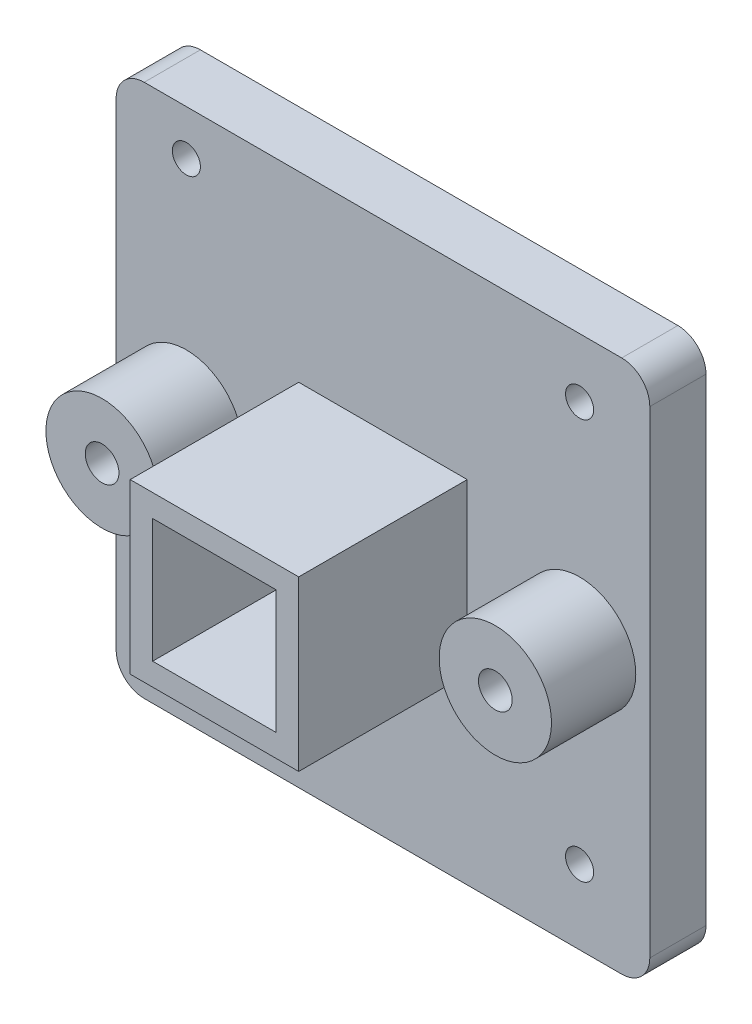
ISO-10303-21;
HEADER;
FILE_DESCRIPTION(('STEP AP214'),'2;1');
FILE_NAME('part.step','',(''),(''),'','','');
FILE_SCHEMA(('AUTOMOTIVE_DESIGN { 1 0 10303 214 1 1 1 1 }'));
ENDSEC;
DATA;
#1=APPLICATION_CONTEXT('core data for automotive mechanical design processes');
#2=APPLICATION_PROTOCOL_DEFINITION('international standard','automotive_design',2000,#1);
#3=PRODUCT_CONTEXT('',#1,'mechanical');
#4=PRODUCT('Part','Part','',(#3));
#5=PRODUCT_RELATED_PRODUCT_CATEGORY('part','',(#4));
#6=PRODUCT_DEFINITION_FORMATION('','',#4);
#7=PRODUCT_DEFINITION_CONTEXT('part definition',#1,'design');
#8=PRODUCT_DEFINITION('design','',#6,#7);
#9=PRODUCT_DEFINITION_SHAPE('','',#8);
#10=(LENGTH_UNIT() NAMED_UNIT(*) SI_UNIT(.MILLI.,.METRE.));
#11=(NAMED_UNIT(*) PLANE_ANGLE_UNIT() SI_UNIT($,.RADIAN.));
#12=(NAMED_UNIT(*) SI_UNIT($,.STERADIAN.) SOLID_ANGLE_UNIT());
#13=UNCERTAINTY_MEASURE_WITH_UNIT(LENGTH_MEASURE(1.E-05),#10,'distance_accuracy_value','');
#14=(GEOMETRIC_REPRESENTATION_CONTEXT(3) GLOBAL_UNCERTAINTY_ASSIGNED_CONTEXT((#13)) GLOBAL_UNIT_ASSIGNED_CONTEXT((#10,
#11,#12)) REPRESENTATION_CONTEXT('',''));
#15=CARTESIAN_POINT('',(0.,0.,0.));
#16=DIRECTION('',(0.,0.,1.));
#17=DIRECTION('',(1.,0.,0.));
#18=AXIS2_PLACEMENT_3D('',#15,#16,#17);
#19=CARTESIAN_POINT('',(0.,0.,20.));
#20=DIRECTION('',(0.,0.,-1.));
#21=DIRECTION('',(-1.,0.,0.));
#22=AXIS2_PLACEMENT_3D('',#19,#20,#21);
#23=PLANE('',#22);
#24=CARTESIAN_POINT('',(-70.,78.9364396639575,20.));
#25=DIRECTION('',(0.,0.,1.));
#26=DIRECTION('',(1.,0.,0.));
#27=AXIS2_PLACEMENT_3D('',#24,#25,#26);
#28=CIRCLE('',#27,5.00000000000001);
#29=CARTESIAN_POINT('',(-65.,78.9364396639575,20.));
#30=VERTEX_POINT('',#29);
#31=EDGE_CURVE('E219',#30,#30,#28,.T.);
#32=ORIENTED_EDGE('',*,*,#31,.F.);
#33=EDGE_LOOP('',(#32));
#34=FACE_BOUND('',#33,.T.);
#35=CARTESIAN_POINT('',(70.,73.9364396639575,20.));
#36=DIRECTION('',(0.,0.,1.));
#37=DIRECTION('',(1.,0.,0.));
#38=AXIS2_PLACEMENT_3D('',#35,#36,#37);
#39=CIRCLE('',#38,5.00000000000001);
#40=CARTESIAN_POINT('',(75.,73.9364396639575,20.));
#41=VERTEX_POINT('',#40);
#42=EDGE_CURVE('E225',#41,#41,#39,.T.);
#43=ORIENTED_EDGE('',*,*,#42,.F.);
#44=EDGE_LOOP('',(#43));
#45=FACE_BOUND('',#44,.T.);
#46=CARTESIAN_POINT('',(-70.,-73.5968858543431,20.));
#47=DIRECTION('',(0.,0.,1.));
#48=DIRECTION('',(1.,0.,0.));
#49=AXIS2_PLACEMENT_3D('',#46,#47,#48);
#50=CIRCLE('',#49,5.00000000000001);
#51=CARTESIAN_POINT('',(-65.,-73.5968858543431,20.));
#52=VERTEX_POINT('',#51);
#53=EDGE_CURVE('E231',#52,#52,#50,.T.);
#54=ORIENTED_EDGE('',*,*,#53,.F.);
#55=EDGE_LOOP('',(#54));
#56=FACE_BOUND('',#55,.T.);
#57=CARTESIAN_POINT('',(70.,-68.5968858543431,20.));
#58=DIRECTION('',(0.,0.,1.));
#59=DIRECTION('',(1.,0.,0.));
#60=AXIS2_PLACEMENT_3D('',#57,#58,#59);
#61=CIRCLE('',#60,5.00000000000001);
#62=CARTESIAN_POINT('',(75.,-68.5968858543431,20.));
#63=VERTEX_POINT('',#62);
#64=EDGE_CURVE('E237',#63,#63,#61,.T.);
#65=ORIENTED_EDGE('',*,*,#64,.F.);
#66=EDGE_LOOP('',(#65));
#67=FACE_BOUND('',#66,.T.);
#68=DIRECTION('',(0.,1.,0.));
#69=VECTOR('',#68,1.);
#70=CARTESIAN_POINT('',(95.,-95.,20.));
#71=LINE('',#70,#69);
#72=CARTESIAN_POINT('',(95.,-85.,20.));
#73=VERTEX_POINT('',#72);
#74=CARTESIAN_POINT('',(95.,85.,20.));
#75=VERTEX_POINT('',#74);
#76=EDGE_CURVE('E261',#73,#75,#71,.T.);
#77=ORIENTED_EDGE('',*,*,#76,.T.);
#78=CARTESIAN_POINT('',(85.,85.,20.));
#79=DIRECTION('',(0.,0.,-1.));
#80=DIRECTION('',(-1.,0.,0.));
#81=AXIS2_PLACEMENT_3D('',#78,#79,#80);
#82=CIRCLE('',#81,10.);
#83=CARTESIAN_POINT('',(85.,95.,20.));
#84=VERTEX_POINT('',#83);
#85=EDGE_CURVE('E314',#75,#84,#82,.F.);
#86=ORIENTED_EDGE('',*,*,#85,.T.);
#87=DIRECTION('',(-1.,0.,0.));
#88=VECTOR('',#87,1.);
#89=CARTESIAN_POINT('',(-95.,95.,20.));
#90=LINE('',#89,#88);
#91=CARTESIAN_POINT('',(-85.,95.,20.));
#92=VERTEX_POINT('',#91);
#93=EDGE_CURVE('E264',#84,#92,#90,.T.);
#94=ORIENTED_EDGE('',*,*,#93,.T.);
#95=CARTESIAN_POINT('',(-85.,85.,20.));
#96=DIRECTION('',(0.,0.,-1.));
#97=DIRECTION('',(-1.,0.,0.));
#98=AXIS2_PLACEMENT_3D('',#95,#96,#97);
#99=CIRCLE('',#98,10.);
#100=CARTESIAN_POINT('',(-95.,85.,20.));
#101=VERTEX_POINT('',#100);
#102=EDGE_CURVE('E312',#92,#101,#99,.F.);
#103=ORIENTED_EDGE('',*,*,#102,.T.);
#104=DIRECTION('',(0.,-1.,0.));
#105=VECTOR('',#104,1.);
#106=CARTESIAN_POINT('',(-95.,-95.,20.));
#107=LINE('',#106,#105);
#108=CARTESIAN_POINT('',(-95.,-85.,20.));
#109=VERTEX_POINT('',#108);
#110=EDGE_CURVE('E268',#101,#109,#107,.T.);
#111=ORIENTED_EDGE('',*,*,#110,.T.);
#112=CARTESIAN_POINT('',(-85.,-85.,20.));
#113=DIRECTION('',(0.,0.,-1.));
#114=DIRECTION('',(-1.,0.,0.));
#115=AXIS2_PLACEMENT_3D('',#112,#113,#114);
#116=CIRCLE('',#115,10.);
#117=CARTESIAN_POINT('',(-85.,-95.,20.));
#118=VERTEX_POINT('',#117);
#119=EDGE_CURVE('E310',#109,#118,#116,.F.);
#120=ORIENTED_EDGE('',*,*,#119,.T.);
#121=DIRECTION('',(1.,0.,0.));
#122=VECTOR('',#121,1.);
#123=CARTESIAN_POINT('',(-95.,-95.,20.));
#124=LINE('',#123,#122);
#125=CARTESIAN_POINT('',(85.,-95.,20.));
#126=VERTEX_POINT('',#125);
#127=EDGE_CURVE('E271',#118,#126,#124,.T.);
#128=ORIENTED_EDGE('',*,*,#127,.T.);
#129=CARTESIAN_POINT('',(85.,-85.,20.));
#130=DIRECTION('',(0.,0.,-1.));
#131=DIRECTION('',(-1.,0.,0.));
#132=AXIS2_PLACEMENT_3D('',#129,#130,#131);
#133=CIRCLE('',#132,10.);
#134=EDGE_CURVE('E308',#126,#73,#133,.F.);
#135=ORIENTED_EDGE('',*,*,#134,.T.);
#136=EDGE_LOOP('',(#77,#86,#94,#103,#111,#120,#128,#135));
#137=FACE_BOUND('',#136,.T.);
#138=CARTESIAN_POINT('',(-70.,0.,20.));
#139=DIRECTION('',(0.,0.,1.));
#140=DIRECTION('',(1.,0.,0.));
#141=AXIS2_PLACEMENT_3D('',#138,#139,#140);
#142=CIRCLE('',#141,20.);
#143=CARTESIAN_POINT('',(-50.,0.,20.));
#144=VERTEX_POINT('',#143);
#145=EDGE_CURVE('E257',#144,#144,#142,.T.);
#146=ORIENTED_EDGE('',*,*,#145,.F.);
#147=EDGE_LOOP('',(#146));
#148=FACE_BOUND('',#147,.T.);
#149=CARTESIAN_POINT('',(70.,0.,20.));
#150=DIRECTION('',(0.,0.,1.));
#151=DIRECTION('',(1.,0.,0.));
#152=AXIS2_PLACEMENT_3D('',#149,#150,#151);
#153=CIRCLE('',#152,20.);
#154=CARTESIAN_POINT('',(90.,0.,20.));
#155=VERTEX_POINT('',#154);
#156=EDGE_CURVE('E158',#155,#155,#153,.T.);
#157=ORIENTED_EDGE('',*,*,#156,.F.);
#158=EDGE_LOOP('',(#157));
#159=FACE_BOUND('',#158,.T.);
#160=DIRECTION('',(0.,1.,0.));
#161=VECTOR('',#160,1.);
#162=CARTESIAN_POINT('',(30.,0.,20.));
#163=LINE('',#162,#161);
#164=CARTESIAN_POINT('',(30.,-30.,20.));
#165=VERTEX_POINT('',#164);
#166=CARTESIAN_POINT('',(30.,30.,20.));
#167=VERTEX_POINT('',#166);
#168=EDGE_CURVE('E204',#165,#167,#163,.T.);
#169=ORIENTED_EDGE('',*,*,#168,.F.);
#170=DIRECTION('',(1.,0.,0.));
#171=VECTOR('',#170,1.);
#172=CARTESIAN_POINT('',(0.,-30.,20.));
#173=LINE('',#172,#171);
#174=CARTESIAN_POINT('',(-30.,-30.,20.));
#175=VERTEX_POINT('',#174);
#176=EDGE_CURVE('E199',#175,#165,#173,.T.);
#177=ORIENTED_EDGE('',*,*,#176,.F.);
#178=DIRECTION('',(0.,-1.,0.));
#179=VECTOR('',#178,1.);
#180=CARTESIAN_POINT('',(-30.,0.,20.));
#181=LINE('',#180,#179);
#182=CARTESIAN_POINT('',(-30.,30.,20.));
#183=VERTEX_POINT('',#182);
#184=EDGE_CURVE('E57',#183,#175,#181,.T.);
#185=ORIENTED_EDGE('',*,*,#184,.F.);
#186=DIRECTION('',(-1.,0.,0.));
#187=VECTOR('',#186,1.);
#188=CARTESIAN_POINT('',(0.,30.,20.));
#189=LINE('',#188,#187);
#190=EDGE_CURVE('E52',#167,#183,#189,.T.);
#191=ORIENTED_EDGE('',*,*,#190,.F.);
#192=EDGE_LOOP('',(#169,#177,#185,#191));
#193=FACE_BOUND('',#192,.T.);
#194=ADVANCED_FACE('F37',(#34,#45,#56,#67,#137,#148,#159,#193),#23,.F.);
#195=CARTESIAN_POINT('',(0.,0.,0.));
#196=DIRECTION('',(0.,0.,-1.));
#197=DIRECTION('',(-1.,0.,0.));
#198=AXIS2_PLACEMENT_3D('',#195,#196,#197);
#199=PLANE('',#198);
#200=DIRECTION('',(1.,0.,0.));
#201=VECTOR('',#200,1.);
#202=CARTESIAN_POINT('',(-22.,-22.,0.));
#203=LINE('',#202,#201);
#204=CARTESIAN_POINT('',(-22.,-22.,0.));
#205=VERTEX_POINT('',#204);
#206=CARTESIAN_POINT('',(22.,-22.,0.));
#207=VERTEX_POINT('',#206);
#208=EDGE_CURVE('E248',#205,#207,#203,.T.);
#209=ORIENTED_EDGE('',*,*,#208,.T.);
#210=DIRECTION('',(0.,1.,0.));
#211=VECTOR('',#210,1.);
#212=CARTESIAN_POINT('',(22.,-22.,0.));
#213=LINE('',#212,#211);
#214=CARTESIAN_POINT('',(22.,22.,0.));
#215=VERTEX_POINT('',#214);
#216=EDGE_CURVE('E240',#207,#215,#213,.T.);
#217=ORIENTED_EDGE('',*,*,#216,.T.);
#218=DIRECTION('',(-1.,0.,0.));
#219=VECTOR('',#218,1.);
#220=CARTESIAN_POINT('',(-22.,22.,0.));
#221=LINE('',#220,#219);
#222=CARTESIAN_POINT('',(-22.,22.,0.));
#223=VERTEX_POINT('',#222);
#224=EDGE_CURVE('E155',#215,#223,#221,.T.);
#225=ORIENTED_EDGE('',*,*,#224,.T.);
#226=DIRECTION('',(0.,-1.,0.));
#227=VECTOR('',#226,1.);
#228=CARTESIAN_POINT('',(-22.,-22.,0.));
#229=LINE('',#228,#227);
#230=EDGE_CURVE('E245',#223,#205,#229,.T.);
#231=ORIENTED_EDGE('',*,*,#230,.T.);
#232=EDGE_LOOP('',(#209,#217,#225,#231));
#233=FACE_BOUND('',#232,.T.);
#234=CARTESIAN_POINT('',(-70.,78.9364396639575,0.));
#235=DIRECTION('',(0.,0.,1.));
#236=DIRECTION('',(1.,0.,0.));
#237=AXIS2_PLACEMENT_3D('',#234,#235,#236);
#238=CIRCLE('',#237,5.00000000000001);
#239=CARTESIAN_POINT('',(-65.,78.9364396639575,0.));
#240=VERTEX_POINT('',#239);
#241=EDGE_CURVE('E218',#240,#240,#238,.T.);
#242=ORIENTED_EDGE('',*,*,#241,.T.);
#243=EDGE_LOOP('',(#242));
#244=FACE_BOUND('',#243,.T.);
#245=CARTESIAN_POINT('',(-70.,-73.5968858543431,0.));
#246=DIRECTION('',(0.,0.,1.));
#247=DIRECTION('',(1.,0.,0.));
#248=AXIS2_PLACEMENT_3D('',#245,#246,#247);
#249=CIRCLE('',#248,5.00000000000001);
#250=CARTESIAN_POINT('',(-65.,-73.5968858543431,0.));
#251=VERTEX_POINT('',#250);
#252=EDGE_CURVE('E228',#251,#251,#249,.T.);
#253=ORIENTED_EDGE('',*,*,#252,.T.);
#254=EDGE_LOOP('',(#253));
#255=FACE_BOUND('',#254,.T.);
#256=DIRECTION('',(-1.,0.,0.));
#257=VECTOR('',#256,1.);
#258=CARTESIAN_POINT('',(-95.,95.,0.));
#259=LINE('',#258,#257);
#260=CARTESIAN_POINT('',(85.,95.,0.));
#261=VERTEX_POINT('',#260);
#262=CARTESIAN_POINT('',(-85.,95.,0.));
#263=VERTEX_POINT('',#262);
#264=EDGE_CURVE('E277',#261,#263,#259,.T.);
#265=ORIENTED_EDGE('',*,*,#264,.F.);
#266=CARTESIAN_POINT('',(85.,85.,0.));
#267=DIRECTION('',(0.,0.,-1.));
#268=DIRECTION('',(-1.,0.,0.));
#269=AXIS2_PLACEMENT_3D('',#266,#267,#268);
#270=CIRCLE('',#269,10.);
#271=CARTESIAN_POINT('',(95.,85.,0.));
#272=VERTEX_POINT('',#271);
#273=EDGE_CURVE('E301',#261,#272,#270,.T.);
#274=ORIENTED_EDGE('',*,*,#273,.T.);
#275=DIRECTION('',(0.,1.,0.));
#276=VECTOR('',#275,1.);
#277=CARTESIAN_POINT('',(95.,-95.,0.));
#278=LINE('',#277,#276);
#279=CARTESIAN_POINT('',(95.,-85.,0.));
#280=VERTEX_POINT('',#279);
#281=EDGE_CURVE('E260',#280,#272,#278,.T.);
#282=ORIENTED_EDGE('',*,*,#281,.F.);
#283=CARTESIAN_POINT('',(85.,-85.,0.));
#284=DIRECTION('',(0.,0.,-1.));
#285=DIRECTION('',(-1.,0.,0.));
#286=AXIS2_PLACEMENT_3D('',#283,#284,#285);
#287=CIRCLE('',#286,10.);
#288=CARTESIAN_POINT('',(85.,-95.,0.));
#289=VERTEX_POINT('',#288);
#290=EDGE_CURVE('E295',#280,#289,#287,.T.);
#291=ORIENTED_EDGE('',*,*,#290,.T.);
#292=DIRECTION('',(1.,0.,0.));
#293=VECTOR('',#292,1.);
#294=CARTESIAN_POINT('',(-95.,-95.,0.));
#295=LINE('',#294,#293);
#296=CARTESIAN_POINT('',(-85.,-95.,0.));
#297=VERTEX_POINT('',#296);
#298=EDGE_CURVE('E265',#297,#289,#295,.T.);
#299=ORIENTED_EDGE('',*,*,#298,.F.);
#300=CARTESIAN_POINT('',(-85.,-85.,0.));
#301=DIRECTION('',(0.,0.,-1.));
#302=DIRECTION('',(-1.,0.,0.));
#303=AXIS2_PLACEMENT_3D('',#300,#301,#302);
#304=CIRCLE('',#303,10.);
#305=CARTESIAN_POINT('',(-95.,-85.,0.));
#306=VERTEX_POINT('',#305);
#307=EDGE_CURVE('E297',#297,#306,#304,.T.);
#308=ORIENTED_EDGE('',*,*,#307,.T.);
#309=DIRECTION('',(0.,-1.,0.));
#310=VECTOR('',#309,1.);
#311=CARTESIAN_POINT('',(-95.,-95.,0.));
#312=LINE('',#311,#310);
#313=CARTESIAN_POINT('',(-95.,85.,0.));
#314=VERTEX_POINT('',#313);
#315=EDGE_CURVE('E280',#314,#306,#312,.T.);
#316=ORIENTED_EDGE('',*,*,#315,.F.);
#317=CARTESIAN_POINT('',(-85.,85.,0.));
#318=DIRECTION('',(0.,0.,-1.));
#319=DIRECTION('',(-1.,0.,0.));
#320=AXIS2_PLACEMENT_3D('',#317,#318,#319);
#321=CIRCLE('',#320,10.);
#322=EDGE_CURVE('E299',#314,#263,#321,.T.);
#323=ORIENTED_EDGE('',*,*,#322,.T.);
#324=EDGE_LOOP('',(#265,#274,#282,#291,#299,#308,#316,#323));
#325=FACE_BOUND('',#324,.T.);
#326=CARTESIAN_POINT('',(70.,-68.5968858543431,0.));
#327=DIRECTION('',(0.,0.,1.));
#328=DIRECTION('',(1.,0.,0.));
#329=AXIS2_PLACEMENT_3D('',#326,#327,#328);
#330=CIRCLE('',#329,5.00000000000001);
#331=CARTESIAN_POINT('',(75.,-68.5968858543431,0.));
#332=VERTEX_POINT('',#331);
#333=EDGE_CURVE('E234',#332,#332,#330,.T.);
#334=ORIENTED_EDGE('',*,*,#333,.T.);
#335=EDGE_LOOP('',(#334));
#336=FACE_BOUND('',#335,.T.);
#337=CARTESIAN_POINT('',(70.,73.9364396639575,0.));
#338=DIRECTION('',(0.,0.,1.));
#339=DIRECTION('',(1.,0.,0.));
#340=AXIS2_PLACEMENT_3D('',#337,#338,#339);
#341=CIRCLE('',#340,5.00000000000001);
#342=CARTESIAN_POINT('',(75.,73.9364396639575,0.));
#343=VERTEX_POINT('',#342);
#344=EDGE_CURVE('E222',#343,#343,#341,.T.);
#345=ORIENTED_EDGE('',*,*,#344,.T.);
#346=EDGE_LOOP('',(#345));
#347=FACE_BOUND('',#346,.T.);
#348=ADVANCED_FACE('F339',(#233,#244,#255,#325,#336,#347),#199,.T.);
#349=CARTESIAN_POINT('',(95.,-95.,20.));
#350=DIRECTION('',(-1.,0.,0.));
#351=DIRECTION('',(0.,0.,1.));
#352=AXIS2_PLACEMENT_3D('',#349,#350,#351);
#353=PLANE('',#352);
#354=ORIENTED_EDGE('',*,*,#281,.T.);
#355=DIRECTION('',(0.,0.,-1.));
#356=VECTOR('',#355,1.);
#357=CARTESIAN_POINT('',(95.,85.,20.));
#358=LINE('',#357,#356);
#359=EDGE_CURVE('E306',#272,#75,#358,.F.);
#360=ORIENTED_EDGE('',*,*,#359,.T.);
#361=ORIENTED_EDGE('',*,*,#76,.F.);
#362=DIRECTION('',(0.,0.,-1.));
#363=VECTOR('',#362,1.);
#364=CARTESIAN_POINT('',(95.,-85.,20.));
#365=LINE('',#364,#363);
#366=EDGE_CURVE('E303',#73,#280,#365,.T.);
#367=ORIENTED_EDGE('',*,*,#366,.T.);
#368=EDGE_LOOP('',(#354,#360,#361,#367));
#369=FACE_BOUND('',#368,.T.);
#370=ADVANCED_FACE('F335',(#369),#353,.F.);
#371=CARTESIAN_POINT('',(-95.,95.,20.));
#372=DIRECTION('',(0.,-1.,0.));
#373=DIRECTION('',(0.,0.,-1.));
#374=AXIS2_PLACEMENT_3D('',#371,#372,#373);
#375=PLANE('',#374);
#376=ORIENTED_EDGE('',*,*,#93,.F.);
#377=DIRECTION('',(0.,0.,-1.));
#378=VECTOR('',#377,1.);
#379=CARTESIAN_POINT('',(85.,95.,20.));
#380=LINE('',#379,#378);
#381=EDGE_CURVE('E292',#84,#261,#380,.T.);
#382=ORIENTED_EDGE('',*,*,#381,.T.);
#383=ORIENTED_EDGE('',*,*,#264,.T.);
#384=DIRECTION('',(0.,0.,-1.));
#385=VECTOR('',#384,1.);
#386=CARTESIAN_POINT('',(-85.,95.,20.));
#387=LINE('',#386,#385);
#388=EDGE_CURVE('E290',#263,#92,#387,.F.);
#389=ORIENTED_EDGE('',*,*,#388,.T.);
#390=EDGE_LOOP('',(#376,#382,#383,#389));
#391=FACE_BOUND('',#390,.T.);
#392=ADVANCED_FACE('F347',(#391),#375,.F.);
#393=CARTESIAN_POINT('',(-95.,-95.,20.));
#394=DIRECTION('',(1.,0.,0.));
#395=DIRECTION('',(0.,0.,-1.));
#396=AXIS2_PLACEMENT_3D('',#393,#394,#395);
#397=PLANE('',#396);
#398=ORIENTED_EDGE('',*,*,#110,.F.);
#399=DIRECTION('',(0.,0.,-1.));
#400=VECTOR('',#399,1.);
#401=CARTESIAN_POINT('',(-95.,85.,20.));
#402=LINE('',#401,#400);
#403=EDGE_CURVE('E318',#101,#314,#402,.T.);
#404=ORIENTED_EDGE('',*,*,#403,.T.);
#405=ORIENTED_EDGE('',*,*,#315,.T.);
#406=DIRECTION('',(0.,0.,-1.));
#407=VECTOR('',#406,1.);
#408=CARTESIAN_POINT('',(-95.,-85.,20.));
#409=LINE('',#408,#407);
#410=EDGE_CURVE('E316',#306,#109,#409,.F.);
#411=ORIENTED_EDGE('',*,*,#410,.T.);
#412=EDGE_LOOP('',(#398,#404,#405,#411));
#413=FACE_BOUND('',#412,.T.);
#414=ADVANCED_FACE('F356',(#413),#397,.F.);
#415=CARTESIAN_POINT('',(-95.,-95.,20.));
#416=DIRECTION('',(0.,1.,0.));
#417=DIRECTION('',(0.,0.,1.));
#418=AXIS2_PLACEMENT_3D('',#415,#416,#417);
#419=PLANE('',#418);
#420=ORIENTED_EDGE('',*,*,#127,.F.);
#421=DIRECTION('',(0.,0.,-1.));
#422=VECTOR('',#421,1.);
#423=CARTESIAN_POINT('',(-85.,-95.,20.));
#424=LINE('',#423,#422);
#425=EDGE_CURVE('E11',#118,#297,#424,.T.);
#426=ORIENTED_EDGE('',*,*,#425,.T.);
#427=ORIENTED_EDGE('',*,*,#298,.T.);
#428=DIRECTION('',(0.,0.,-1.));
#429=VECTOR('',#428,1.);
#430=CARTESIAN_POINT('',(85.,-95.,20.));
#431=LINE('',#430,#429);
#432=EDGE_CURVE('E45',#289,#126,#431,.F.);
#433=ORIENTED_EDGE('',*,*,#432,.T.);
#434=EDGE_LOOP('',(#420,#426,#427,#433));
#435=FACE_BOUND('',#434,.T.);
#436=ADVANCED_FACE('F323',(#435),#419,.F.);
#437=CARTESIAN_POINT('',(22.,-22.,20.));
#438=DIRECTION('',(-1.,0.,0.));
#439=DIRECTION('',(0.,0.,1.));
#440=AXIS2_PLACEMENT_3D('',#437,#438,#439);
#441=PLANE('',#440);
#442=ORIENTED_EDGE('',*,*,#216,.F.);
#443=DIRECTION('',(0.,0.,-1.));
#444=VECTOR('',#443,1.);
#445=CARTESIAN_POINT('',(22.,-22.,20.));
#446=LINE('',#445,#444);
#447=CARTESIAN_POINT('',(22.,-22.,80.));
#448=VERTEX_POINT('',#447);
#449=EDGE_CURVE('E165',#448,#207,#446,.T.);
#450=ORIENTED_EDGE('',*,*,#449,.F.);
#451=DIRECTION('',(0.,1.,0.));
#452=VECTOR('',#451,1.);
#453=CARTESIAN_POINT('',(22.,-22.,80.));
#454=LINE('',#453,#452);
#455=CARTESIAN_POINT('',(22.,22.,80.));
#456=VERTEX_POINT('',#455);
#457=EDGE_CURVE('E162',#448,#456,#454,.T.);
#458=ORIENTED_EDGE('',*,*,#457,.T.);
#459=DIRECTION('',(0.,0.,-1.));
#460=VECTOR('',#459,1.);
#461=CARTESIAN_POINT('',(22.,22.,20.));
#462=LINE('',#461,#460);
#463=EDGE_CURVE('E148',#456,#215,#462,.T.);
#464=ORIENTED_EDGE('',*,*,#463,.T.);
#465=EDGE_LOOP('',(#442,#450,#458,#464));
#466=FACE_BOUND('',#465,.T.);
#467=ADVANCED_FACE('F163',(#466),#441,.T.);
#468=CARTESIAN_POINT('',(-22.,22.,20.));
#469=DIRECTION('',(0.,-1.,0.));
#470=DIRECTION('',(0.,0.,-1.));
#471=AXIS2_PLACEMENT_3D('',#468,#469,#470);
#472=PLANE('',#471);
#473=ORIENTED_EDGE('',*,*,#224,.F.);
#474=ORIENTED_EDGE('',*,*,#463,.F.);
#475=DIRECTION('',(-1.,0.,0.));
#476=VECTOR('',#475,1.);
#477=CARTESIAN_POINT('',(-22.,22.,80.));
#478=LINE('',#477,#476);
#479=CARTESIAN_POINT('',(-22.,22.,80.));
#480=VERTEX_POINT('',#479);
#481=EDGE_CURVE('E152',#456,#480,#478,.T.);
#482=ORIENTED_EDGE('',*,*,#481,.T.);
#483=DIRECTION('',(0.,0.,-1.));
#484=VECTOR('',#483,1.);
#485=CARTESIAN_POINT('',(-22.,22.,20.));
#486=LINE('',#485,#484);
#487=EDGE_CURVE('E159',#480,#223,#486,.T.);
#488=ORIENTED_EDGE('',*,*,#487,.T.);
#489=EDGE_LOOP('',(#473,#474,#482,#488));
#490=FACE_BOUND('',#489,.T.);
#491=ADVANCED_FACE('F150',(#490),#472,.T.);
#492=CARTESIAN_POINT('',(-22.,-22.,20.));
#493=DIRECTION('',(1.,0.,0.));
#494=DIRECTION('',(0.,0.,-1.));
#495=AXIS2_PLACEMENT_3D('',#492,#493,#494);
#496=PLANE('',#495);
#497=ORIENTED_EDGE('',*,*,#230,.F.);
#498=ORIENTED_EDGE('',*,*,#487,.F.);
#499=DIRECTION('',(0.,-1.,0.));
#500=VECTOR('',#499,1.);
#501=CARTESIAN_POINT('',(-22.,-22.,80.));
#502=LINE('',#501,#500);
#503=CARTESIAN_POINT('',(-22.,-22.,80.));
#504=VERTEX_POINT('',#503);
#505=EDGE_CURVE('E172',#480,#504,#502,.T.);
#506=ORIENTED_EDGE('',*,*,#505,.T.);
#507=DIRECTION('',(0.,0.,-1.));
#508=VECTOR('',#507,1.);
#509=CARTESIAN_POINT('',(-22.,-22.,20.));
#510=LINE('',#509,#508);
#511=EDGE_CURVE('E252',#504,#205,#510,.T.);
#512=ORIENTED_EDGE('',*,*,#511,.T.);
#513=EDGE_LOOP('',(#497,#498,#506,#512));
#514=FACE_BOUND('',#513,.T.);
#515=ADVANCED_FACE('F447',(#514),#496,.T.);
#516=CARTESIAN_POINT('',(-22.,-22.,20.));
#517=DIRECTION('',(0.,1.,0.));
#518=DIRECTION('',(0.,0.,1.));
#519=AXIS2_PLACEMENT_3D('',#516,#517,#518);
#520=PLANE('',#519);
#521=ORIENTED_EDGE('',*,*,#208,.F.);
#522=ORIENTED_EDGE('',*,*,#511,.F.);
#523=DIRECTION('',(1.,0.,0.));
#524=VECTOR('',#523,1.);
#525=CARTESIAN_POINT('',(-22.,-22.,80.));
#526=LINE('',#525,#524);
#527=EDGE_CURVE('E174',#504,#448,#526,.T.);
#528=ORIENTED_EDGE('',*,*,#527,.T.);
#529=ORIENTED_EDGE('',*,*,#449,.T.);
#530=EDGE_LOOP('',(#521,#522,#528,#529));
#531=FACE_BOUND('',#530,.T.);
#532=ADVANCED_FACE('F443',(#531),#520,.T.);
#533=CARTESIAN_POINT('',(70.,-68.5968858543431,20.));
#534=DIRECTION('',(0.,0.,-1.));
#535=DIRECTION('',(-1.,0.,0.));
#536=AXIS2_PLACEMENT_3D('',#533,#534,#535);
#537=CYLINDRICAL_SURFACE('',#536,5.00000000000001);
#538=ORIENTED_EDGE('',*,*,#64,.T.);
#539=EDGE_LOOP('',(#538));
#540=FACE_BOUND('',#539,.T.);
#541=ORIENTED_EDGE('',*,*,#333,.F.);
#542=EDGE_LOOP('',(#541));
#543=FACE_BOUND('',#542,.T.);
#544=ADVANCED_FACE('F439',(#540,#543),#537,.F.);
#545=CARTESIAN_POINT('',(-70.,-73.5968858543431,20.));
#546=DIRECTION('',(0.,0.,-1.));
#547=DIRECTION('',(-1.,0.,0.));
#548=AXIS2_PLACEMENT_3D('',#545,#546,#547);
#549=CYLINDRICAL_SURFACE('',#548,5.00000000000001);
#550=ORIENTED_EDGE('',*,*,#53,.T.);
#551=EDGE_LOOP('',(#550));
#552=FACE_BOUND('',#551,.T.);
#553=ORIENTED_EDGE('',*,*,#252,.F.);
#554=EDGE_LOOP('',(#553));
#555=FACE_BOUND('',#554,.T.);
#556=ADVANCED_FACE('F435',(#552,#555),#549,.F.);
#557=CARTESIAN_POINT('',(70.,73.9364396639575,20.));
#558=DIRECTION('',(0.,0.,-1.));
#559=DIRECTION('',(-1.,0.,0.));
#560=AXIS2_PLACEMENT_3D('',#557,#558,#559);
#561=CYLINDRICAL_SURFACE('',#560,5.00000000000001);
#562=ORIENTED_EDGE('',*,*,#42,.T.);
#563=EDGE_LOOP('',(#562));
#564=FACE_BOUND('',#563,.T.);
#565=ORIENTED_EDGE('',*,*,#344,.F.);
#566=EDGE_LOOP('',(#565));
#567=FACE_BOUND('',#566,.T.);
#568=ADVANCED_FACE('F431',(#564,#567),#561,.F.);
#569=CARTESIAN_POINT('',(-70.,78.9364396639575,20.));
#570=DIRECTION('',(0.,0.,-1.));
#571=DIRECTION('',(-1.,0.,0.));
#572=AXIS2_PLACEMENT_3D('',#569,#570,#571);
#573=CYLINDRICAL_SURFACE('',#572,5.00000000000001);
#574=ORIENTED_EDGE('',*,*,#31,.T.);
#575=EDGE_LOOP('',(#574));
#576=FACE_BOUND('',#575,.T.);
#577=ORIENTED_EDGE('',*,*,#241,.F.);
#578=EDGE_LOOP('',(#577));
#579=FACE_BOUND('',#578,.T.);
#580=ADVANCED_FACE('F427',(#576,#579),#573,.F.);
#581=CARTESIAN_POINT('',(-70.,0.,50.));
#582=DIRECTION('',(0.,0.,-1.));
#583=DIRECTION('',(-1.,0.,0.));
#584=AXIS2_PLACEMENT_3D('',#581,#582,#583);
#585=CYLINDRICAL_SURFACE('',#584,20.);
#586=CARTESIAN_POINT('',(-70.,0.,50.));
#587=DIRECTION('',(0.,0.,1.));
#588=DIRECTION('',(1.,0.,0.));
#589=AXIS2_PLACEMENT_3D('',#586,#587,#588);
#590=CIRCLE('',#589,20.);
#591=CARTESIAN_POINT('',(-50.,0.,50.));
#592=VERTEX_POINT('',#591);
#593=EDGE_CURVE('E215',#592,#592,#590,.T.);
#594=ORIENTED_EDGE('',*,*,#593,.F.);
#595=EDGE_LOOP('',(#594));
#596=FACE_BOUND('',#595,.T.);
#597=ORIENTED_EDGE('',*,*,#145,.T.);
#598=EDGE_LOOP('',(#597));
#599=FACE_BOUND('',#598,.T.);
#600=ADVANCED_FACE('F423',(#596,#599),#585,.T.);
#601=CARTESIAN_POINT('',(-70.,0.,50.));
#602=DIRECTION('',(0.,0.,1.));
#603=DIRECTION('',(1.,0.,0.));
#604=AXIS2_PLACEMENT_3D('',#601,#602,#603);
#605=PLANE('',#604);
#606=ORIENTED_EDGE('',*,*,#593,.T.);
#607=EDGE_LOOP('',(#606));
#608=FACE_BOUND('',#607,.T.);
#609=CARTESIAN_POINT('',(-70.,0.,50.));
#610=DIRECTION('',(0.,0.,1.));
#611=DIRECTION('',(1.,0.,0.));
#612=AXIS2_PLACEMENT_3D('',#609,#610,#611);
#613=CIRCLE('',#612,6.);
#614=CARTESIAN_POINT('',(-64.,0.,50.));
#615=VERTEX_POINT('',#614);
#616=EDGE_CURVE('E212',#615,#615,#613,.T.);
#617=ORIENTED_EDGE('',*,*,#616,.F.);
#618=EDGE_LOOP('',(#617));
#619=FACE_BOUND('',#618,.T.);
#620=ADVANCED_FACE('F419',(#608,#619),#605,.T.);
#621=CARTESIAN_POINT('',(-70.,0.,50.));
#622=DIRECTION('',(0.,0.,-1.));
#623=DIRECTION('',(-1.,0.,0.));
#624=AXIS2_PLACEMENT_3D('',#621,#622,#623);
#625=CYLINDRICAL_SURFACE('',#624,6.);
#626=CARTESIAN_POINT('',(-70.,0.,2.99999999999995));
#627=DIRECTION('',(0.,0.,1.));
#628=DIRECTION('',(1.,0.,0.));
#629=AXIS2_PLACEMENT_3D('',#626,#627,#628);
#630=CIRCLE('',#629,6.);
#631=CARTESIAN_POINT('',(-64.,0.,2.99999999999995));
#632=VERTEX_POINT('',#631);
#633=EDGE_CURVE('E287',#632,#632,#630,.T.);
#634=ORIENTED_EDGE('',*,*,#633,.F.);
#635=EDGE_LOOP('',(#634));
#636=FACE_BOUND('',#635,.T.);
#637=ORIENTED_EDGE('',*,*,#616,.T.);
#638=EDGE_LOOP('',(#637));
#639=FACE_BOUND('',#638,.T.);
#640=ADVANCED_FACE('F415',(#636,#639),#625,.F.);
#641=CARTESIAN_POINT('',(70.,0.,50.));
#642=DIRECTION('',(0.,0.,-1.));
#643=DIRECTION('',(-1.,0.,0.));
#644=AXIS2_PLACEMENT_3D('',#641,#642,#643);
#645=CYLINDRICAL_SURFACE('',#644,20.);
#646=CARTESIAN_POINT('',(70.,0.,50.));
#647=DIRECTION('',(0.,0.,1.));
#648=DIRECTION('',(1.,0.,0.));
#649=AXIS2_PLACEMENT_3D('',#646,#647,#648);
#650=CIRCLE('',#649,20.);
#651=CARTESIAN_POINT('',(90.,0.,50.));
#652=VERTEX_POINT('',#651);
#653=EDGE_CURVE('E209',#652,#652,#650,.T.);
#654=ORIENTED_EDGE('',*,*,#653,.F.);
#655=EDGE_LOOP('',(#654));
#656=FACE_BOUND('',#655,.T.);
#657=ORIENTED_EDGE('',*,*,#156,.T.);
#658=EDGE_LOOP('',(#657));
#659=FACE_BOUND('',#658,.T.);
#660=ADVANCED_FACE('F411',(#656,#659),#645,.T.);
#661=CARTESIAN_POINT('',(70.,0.,50.));
#662=DIRECTION('',(0.,0.,1.));
#663=DIRECTION('',(1.,0.,0.));
#664=AXIS2_PLACEMENT_3D('',#661,#662,#663);
#665=PLANE('',#664);
#666=ORIENTED_EDGE('',*,*,#653,.T.);
#667=EDGE_LOOP('',(#666));
#668=FACE_BOUND('',#667,.T.);
#669=CARTESIAN_POINT('',(70.,0.,50.));
#670=DIRECTION('',(0.,0.,1.));
#671=DIRECTION('',(1.,0.,0.));
#672=AXIS2_PLACEMENT_3D('',#669,#670,#671);
#673=CIRCLE('',#672,6.);
#674=CARTESIAN_POINT('',(76.,0.,50.));
#675=VERTEX_POINT('',#674);
#676=EDGE_CURVE('E206',#675,#675,#673,.T.);
#677=ORIENTED_EDGE('',*,*,#676,.F.);
#678=EDGE_LOOP('',(#677));
#679=FACE_BOUND('',#678,.T.);
#680=ADVANCED_FACE('F407',(#668,#679),#665,.T.);
#681=CARTESIAN_POINT('',(70.,0.,50.));
#682=DIRECTION('',(0.,0.,-1.));
#683=DIRECTION('',(-1.,0.,0.));
#684=AXIS2_PLACEMENT_3D('',#681,#682,#683);
#685=CYLINDRICAL_SURFACE('',#684,6.);
#686=CARTESIAN_POINT('',(70.,0.,2.99999999999995));
#687=DIRECTION('',(0.,0.,1.));
#688=DIRECTION('',(1.,0.,0.));
#689=AXIS2_PLACEMENT_3D('',#686,#687,#688);
#690=CIRCLE('',#689,6.);
#691=CARTESIAN_POINT('',(76.,0.,2.99999999999995));
#692=VERTEX_POINT('',#691);
#693=EDGE_CURVE('E274',#692,#692,#690,.T.);
#694=ORIENTED_EDGE('',*,*,#693,.F.);
#695=EDGE_LOOP('',(#694));
#696=FACE_BOUND('',#695,.T.);
#697=ORIENTED_EDGE('',*,*,#676,.T.);
#698=EDGE_LOOP('',(#697));
#699=FACE_BOUND('',#698,.T.);
#700=ADVANCED_FACE('F399',(#696,#699),#685,.F.);
#701=CARTESIAN_POINT('',(70.,0.,2.99999999999995));
#702=DIRECTION('',(0.,0.,1.));
#703=DIRECTION('',(1.,0.,0.));
#704=AXIS2_PLACEMENT_3D('',#701,#702,#703);
#705=PLANE('',#704);
#706=ORIENTED_EDGE('',*,*,#693,.T.);
#707=EDGE_LOOP('',(#706));
#708=FACE_BOUND('',#707,.T.);
#709=ADVANCED_FACE('F393',(#708),#705,.T.);
#710=CARTESIAN_POINT('',(-70.,0.,2.99999999999995));
#711=DIRECTION('',(0.,0.,1.));
#712=DIRECTION('',(1.,0.,0.));
#713=AXIS2_PLACEMENT_3D('',#710,#711,#712);
#714=PLANE('',#713);
#715=ORIENTED_EDGE('',*,*,#633,.T.);
#716=EDGE_LOOP('',(#715));
#717=FACE_BOUND('',#716,.T.);
#718=ADVANCED_FACE('F389',(#717),#714,.T.);
#719=CARTESIAN_POINT('',(85.,85.,20.));
#720=DIRECTION('',(0.,0.,-1.));
#721=DIRECTION('',(-1.,0.,0.));
#722=AXIS2_PLACEMENT_3D('',#719,#720,#721);
#723=CYLINDRICAL_SURFACE('',#722,10.);
#724=ORIENTED_EDGE('',*,*,#85,.F.);
#725=ORIENTED_EDGE('',*,*,#359,.F.);
#726=ORIENTED_EDGE('',*,*,#273,.F.);
#727=ORIENTED_EDGE('',*,*,#381,.F.);
#728=EDGE_LOOP('',(#724,#725,#726,#727));
#729=FACE_BOUND('',#728,.T.);
#730=ADVANCED_FACE('F344',(#729),#723,.T.);
#731=CARTESIAN_POINT('',(-85.,85.,20.));
#732=DIRECTION('',(0.,0.,-1.));
#733=DIRECTION('',(-1.,0.,0.));
#734=AXIS2_PLACEMENT_3D('',#731,#732,#733);
#735=CYLINDRICAL_SURFACE('',#734,10.);
#736=ORIENTED_EDGE('',*,*,#102,.F.);
#737=ORIENTED_EDGE('',*,*,#388,.F.);
#738=ORIENTED_EDGE('',*,*,#322,.F.);
#739=ORIENTED_EDGE('',*,*,#403,.F.);
#740=EDGE_LOOP('',(#736,#737,#738,#739));
#741=FACE_BOUND('',#740,.T.);
#742=ADVANCED_FACE('F353',(#741),#735,.T.);
#743=CARTESIAN_POINT('',(-85.,-85.,20.));
#744=DIRECTION('',(0.,0.,-1.));
#745=DIRECTION('',(-1.,0.,0.));
#746=AXIS2_PLACEMENT_3D('',#743,#744,#745);
#747=CYLINDRICAL_SURFACE('',#746,10.);
#748=ORIENTED_EDGE('',*,*,#119,.F.);
#749=ORIENTED_EDGE('',*,*,#410,.F.);
#750=ORIENTED_EDGE('',*,*,#307,.F.);
#751=ORIENTED_EDGE('',*,*,#425,.F.);
#752=EDGE_LOOP('',(#748,#749,#750,#751));
#753=FACE_BOUND('',#752,.T.);
#754=ADVANCED_FACE('F359',(#753),#747,.T.);
#755=CARTESIAN_POINT('',(85.,-85.,20.));
#756=DIRECTION('',(0.,0.,-1.));
#757=DIRECTION('',(-1.,0.,0.));
#758=AXIS2_PLACEMENT_3D('',#755,#756,#757);
#759=CYLINDRICAL_SURFACE('',#758,10.);
#760=ORIENTED_EDGE('',*,*,#134,.F.);
#761=ORIENTED_EDGE('',*,*,#432,.F.);
#762=ORIENTED_EDGE('',*,*,#290,.F.);
#763=ORIENTED_EDGE('',*,*,#366,.F.);
#764=EDGE_LOOP('',(#760,#761,#762,#763));
#765=FACE_BOUND('',#764,.T.);
#766=ADVANCED_FACE('F39',(#765),#759,.T.);
#767=CARTESIAN_POINT('',(30.,-30.,80.));
#768=DIRECTION('',(-1.,0.,0.));
#769=DIRECTION('',(0.,0.,1.));
#770=AXIS2_PLACEMENT_3D('',#767,#768,#769);
#771=PLANE('',#770);
#772=DIRECTION('',(0.,0.,-1.));
#773=VECTOR('',#772,1.);
#774=CARTESIAN_POINT('',(30.,-30.,80.));
#775=LINE('',#774,#773);
#776=CARTESIAN_POINT('',(30.,-30.,80.));
#777=VERTEX_POINT('',#776);
#778=EDGE_CURVE('E187',#777,#165,#775,.T.);
#779=ORIENTED_EDGE('',*,*,#778,.T.);
#780=ORIENTED_EDGE('',*,*,#168,.T.);
#781=DIRECTION('',(0.,0.,-1.));
#782=VECTOR('',#781,1.);
#783=CARTESIAN_POINT('',(30.,30.,80.));
#784=LINE('',#783,#782);
#785=CARTESIAN_POINT('',(30.,30.,80.));
#786=VERTEX_POINT('',#785);
#787=EDGE_CURVE('E196',#786,#167,#784,.T.);
#788=ORIENTED_EDGE('',*,*,#787,.F.);
#789=DIRECTION('',(0.,1.,0.));
#790=VECTOR('',#789,1.);
#791=CARTESIAN_POINT('',(30.,-30.,80.));
#792=LINE('',#791,#790);
#793=EDGE_CURVE('E178',#777,#786,#792,.T.);
#794=ORIENTED_EDGE('',*,*,#793,.F.);
#795=EDGE_LOOP('',(#779,#780,#788,#794));
#796=FACE_BOUND('',#795,.T.);
#797=ADVANCED_FACE('F365',(#796),#771,.F.);
#798=CARTESIAN_POINT('',(-30.,30.,80.));
#799=DIRECTION('',(0.,-1.,0.));
#800=DIRECTION('',(0.,0.,-1.));
#801=AXIS2_PLACEMENT_3D('',#798,#799,#800);
#802=PLANE('',#801);
#803=ORIENTED_EDGE('',*,*,#787,.T.);
#804=ORIENTED_EDGE('',*,*,#190,.T.);
#805=DIRECTION('',(0.,0.,-1.));
#806=VECTOR('',#805,1.);
#807=CARTESIAN_POINT('',(-30.,30.,80.));
#808=LINE('',#807,#806);
#809=CARTESIAN_POINT('',(-30.,30.,80.));
#810=VERTEX_POINT('',#809);
#811=EDGE_CURVE('E193',#810,#183,#808,.T.);
#812=ORIENTED_EDGE('',*,*,#811,.F.);
#813=DIRECTION('',(-1.,0.,0.));
#814=VECTOR('',#813,1.);
#815=CARTESIAN_POINT('',(-30.,30.,80.));
#816=LINE('',#815,#814);
#817=EDGE_CURVE('E181',#786,#810,#816,.T.);
#818=ORIENTED_EDGE('',*,*,#817,.F.);
#819=EDGE_LOOP('',(#803,#804,#812,#818));
#820=FACE_BOUND('',#819,.T.);
#821=ADVANCED_FACE('F631',(#820),#802,.F.);
#822=CARTESIAN_POINT('',(-30.,-30.,80.));
#823=DIRECTION('',(1.,0.,0.));
#824=DIRECTION('',(0.,0.,-1.));
#825=AXIS2_PLACEMENT_3D('',#822,#823,#824);
#826=PLANE('',#825);
#827=ORIENTED_EDGE('',*,*,#811,.T.);
#828=ORIENTED_EDGE('',*,*,#184,.T.);
#829=DIRECTION('',(0.,0.,-1.));
#830=VECTOR('',#829,1.);
#831=CARTESIAN_POINT('',(-30.,-30.,80.));
#832=LINE('',#831,#830);
#833=CARTESIAN_POINT('',(-30.,-30.,80.));
#834=VERTEX_POINT('',#833);
#835=EDGE_CURVE('E190',#834,#175,#832,.T.);
#836=ORIENTED_EDGE('',*,*,#835,.F.);
#837=DIRECTION('',(0.,-1.,0.));
#838=VECTOR('',#837,1.);
#839=CARTESIAN_POINT('',(-30.,-30.,80.));
#840=LINE('',#839,#838);
#841=EDGE_CURVE('E183',#810,#834,#840,.T.);
#842=ORIENTED_EDGE('',*,*,#841,.F.);
#843=EDGE_LOOP('',(#827,#828,#836,#842));
#844=FACE_BOUND('',#843,.T.);
#845=ADVANCED_FACE('F639',(#844),#826,.F.);
#846=CARTESIAN_POINT('',(-30.,-30.,80.));
#847=DIRECTION('',(0.,1.,0.));
#848=DIRECTION('',(0.,0.,1.));
#849=AXIS2_PLACEMENT_3D('',#846,#847,#848);
#850=PLANE('',#849);
#851=ORIENTED_EDGE('',*,*,#835,.T.);
#852=ORIENTED_EDGE('',*,*,#176,.T.);
#853=ORIENTED_EDGE('',*,*,#778,.F.);
#854=DIRECTION('',(1.,0.,0.));
#855=VECTOR('',#854,1.);
#856=CARTESIAN_POINT('',(-30.,-30.,80.));
#857=LINE('',#856,#855);
#858=EDGE_CURVE('E185',#834,#777,#857,.T.);
#859=ORIENTED_EDGE('',*,*,#858,.F.);
#860=EDGE_LOOP('',(#851,#852,#853,#859));
#861=FACE_BOUND('',#860,.T.);
#862=ADVANCED_FACE('F647',(#861),#850,.F.);
#863=CARTESIAN_POINT('',(0.,0.,80.));
#864=DIRECTION('',(0.,0.,-1.));
#865=DIRECTION('',(-1.,0.,0.));
#866=AXIS2_PLACEMENT_3D('',#863,#864,#865);
#867=PLANE('',#866);
#868=ORIENTED_EDGE('',*,*,#793,.T.);
#869=ORIENTED_EDGE('',*,*,#817,.T.);
#870=ORIENTED_EDGE('',*,*,#841,.T.);
#871=ORIENTED_EDGE('',*,*,#858,.T.);
#872=EDGE_LOOP('',(#868,#869,#870,#871));
#873=FACE_BOUND('',#872,.T.);
#874=ORIENTED_EDGE('',*,*,#457,.F.);
#875=ORIENTED_EDGE('',*,*,#527,.F.);
#876=ORIENTED_EDGE('',*,*,#505,.F.);
#877=ORIENTED_EDGE('',*,*,#481,.F.);
#878=EDGE_LOOP('',(#874,#875,#876,#877));
#879=FACE_BOUND('',#878,.T.);
#880=ADVANCED_FACE('F170',(#873,#879),#867,.F.);
#881=CLOSED_SHELL('',(#194,#348,#370,#392,#414,#436,#467,#491,#515,#532,#544,#556,#568,#580,
#600,#620,#640,#660,#680,#700,#709,#718,#730,#742,#754,#766,#797,#821,#845,#862,#880));
#882=MANIFOLD_SOLID_BREP('B2',#881);
#883=ADVANCED_BREP_SHAPE_REPRESENTATION('',(#18,#882),#14);
#884=SHAPE_DEFINITION_REPRESENTATION(#9,#883);
ENDSEC;
END-ISO-10303-21;
